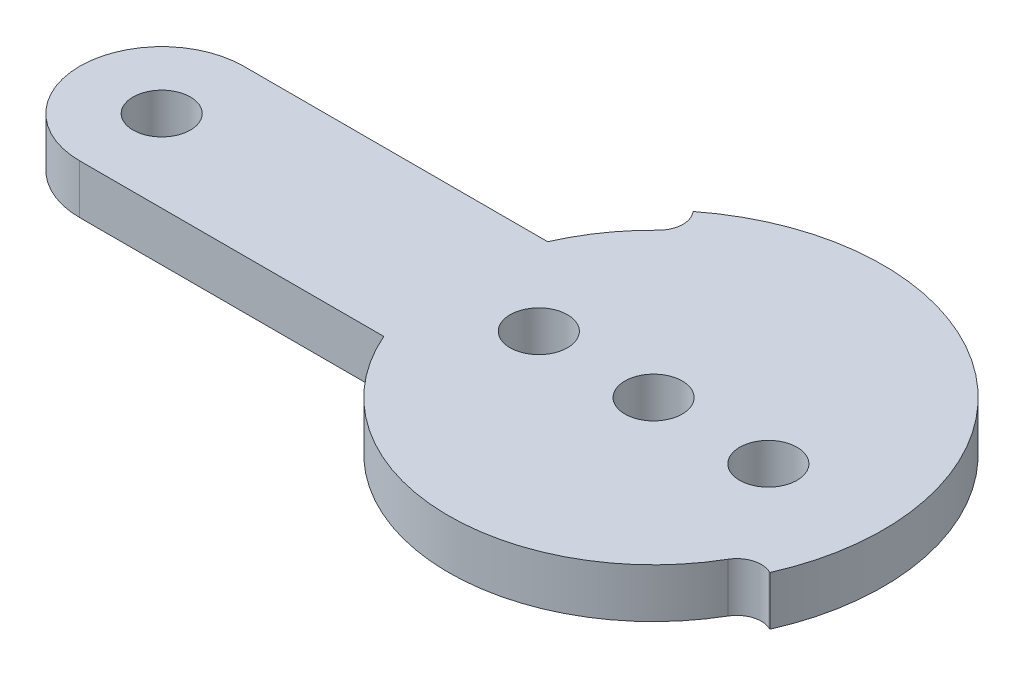
ISO-10303-21;
HEADER;
FILE_DESCRIPTION(('STEP AP214'),'2;1');
FILE_NAME('part.step','',(''),(''),'','','');
FILE_SCHEMA(('AUTOMOTIVE_DESIGN { 1 0 10303 214 1 1 1 1 }'));
ENDSEC;
DATA;
#1=APPLICATION_CONTEXT('core data for automotive mechanical design processes');
#2=APPLICATION_PROTOCOL_DEFINITION('international standard','automotive_design',2000,#1);
#3=PRODUCT_CONTEXT('',#1,'mechanical');
#4=PRODUCT('Part','Part','',(#3));
#5=PRODUCT_RELATED_PRODUCT_CATEGORY('part','',(#4));
#6=PRODUCT_DEFINITION_FORMATION('','',#4);
#7=PRODUCT_DEFINITION_CONTEXT('part definition',#1,'design');
#8=PRODUCT_DEFINITION('design','',#6,#7);
#9=PRODUCT_DEFINITION_SHAPE('','',#8);
#10=(LENGTH_UNIT() NAMED_UNIT(*) SI_UNIT(.MILLI.,.METRE.));
#11=(NAMED_UNIT(*) PLANE_ANGLE_UNIT() SI_UNIT($,.RADIAN.));
#12=(NAMED_UNIT(*) SI_UNIT($,.STERADIAN.) SOLID_ANGLE_UNIT());
#13=UNCERTAINTY_MEASURE_WITH_UNIT(LENGTH_MEASURE(1.E-05),#10,'distance_accuracy_value','');
#14=(GEOMETRIC_REPRESENTATION_CONTEXT(3) GLOBAL_UNCERTAINTY_ASSIGNED_CONTEXT((#13)) GLOBAL_UNIT_ASSIGNED_CONTEXT((#10,
#11,#12)) REPRESENTATION_CONTEXT('',''));
#15=CARTESIAN_POINT('',(0.,0.,0.));
#16=DIRECTION('',(0.,0.,1.));
#17=DIRECTION('',(1.,0.,0.));
#18=AXIS2_PLACEMENT_3D('',#15,#16,#17);
#19=CARTESIAN_POINT('',(0.,-3.,0.));
#20=DIRECTION('',(0.,1.,0.));
#21=DIRECTION('',(0.,0.,1.));
#22=AXIS2_PLACEMENT_3D('',#19,#20,#21);
#23=CYLINDRICAL_SURFACE('',#22,6.);
#24=CARTESIAN_POINT('',(0.,0.,0.));
#25=DIRECTION('',(0.,-1.,0.));
#26=DIRECTION('',(0.,0.,-1.));
#27=AXIS2_PLACEMENT_3D('',#24,#25,#26);
#28=CIRCLE('',#27,6.);
#29=CARTESIAN_POINT('',(-5.85267857142857,0.,-1.32142103038389));
#30=VERTEX_POINT('',#29);
#31=CARTESIAN_POINT('',(5.85267857142857,0.,-1.32142103038389));
#32=VERTEX_POINT('',#31);
#33=EDGE_CURVE('E170',#30,#32,#28,.T.);
#34=ORIENTED_EDGE('',*,*,#33,.T.);
#35=DIRECTION('',(0.,-1.,0.));
#36=VECTOR('',#35,1.);
#37=CARTESIAN_POINT('',(5.85267857142857,0.,-1.32142103038389));
#38=LINE('',#37,#36);
#39=CARTESIAN_POINT('',(5.85267857142857,-3.,-1.32142103038389));
#40=VERTEX_POINT('',#39);
#41=EDGE_CURVE('E168',#32,#40,#38,.T.);
#42=ORIENTED_EDGE('',*,*,#41,.T.);
#43=CARTESIAN_POINT('',(0.,-3.,0.));
#44=DIRECTION('',(0.,-1.,0.));
#45=DIRECTION('',(0.,0.,-1.));
#46=AXIS2_PLACEMENT_3D('',#43,#44,#45);
#47=CIRCLE('',#46,6.);
#48=CARTESIAN_POINT('',(-5.85267857142857,-3.,-1.32142103038389));
#49=VERTEX_POINT('',#48);
#50=EDGE_CURVE('E160',#49,#40,#47,.T.);
#51=ORIENTED_EDGE('',*,*,#50,.F.);
#52=DIRECTION('',(0.,-1.,0.));
#53=VECTOR('',#52,1.);
#54=CARTESIAN_POINT('',(-5.85267857142857,0.,-1.32142103038389));
#55=LINE('',#54,#53);
#56=EDGE_CURVE('E51',#49,#30,#55,.F.);
#57=ORIENTED_EDGE('',*,*,#56,.T.);
#58=EDGE_LOOP('',(#34,#42,#51,#57));
#59=FACE_BOUND('',#58,.T.);
#60=ADVANCED_FACE('F36',(#59),#23,.T.);
#61=CARTESIAN_POINT('',(12.1059096426056,3.,7.0318526524003));
#62=DIRECTION('',(0.,-1.,0.));
#63=DIRECTION('',(0.,0.,-1.));
#64=AXIS2_PLACEMENT_3D('',#61,#62,#63);
#65=PLANE('',#64);
#66=CARTESIAN_POINT('',(7.,3.,0.));
#67=DIRECTION('',(0.,-1.,0.));
#68=DIRECTION('',(0.,0.,-1.));
#69=AXIS2_PLACEMENT_3D('',#66,#67,#68);
#70=CIRCLE('',#69,1.75);
#71=CARTESIAN_POINT('',(7.,3.,-1.75));
#72=VERTEX_POINT('',#71);
#73=EDGE_CURVE('E145',#72,#72,#70,.T.);
#74=ORIENTED_EDGE('',*,*,#73,.T.);
#75=EDGE_LOOP('',(#74));
#76=FACE_BOUND('',#75,.T.);
#77=CARTESIAN_POINT('',(-7.,3.,0.));
#78=DIRECTION('',(0.,-1.,0.));
#79=DIRECTION('',(0.,0.,-1.));
#80=AXIS2_PLACEMENT_3D('',#77,#78,#79);
#81=CIRCLE('',#80,1.75);
#82=CARTESIAN_POINT('',(-7.,3.,-1.75));
#83=VERTEX_POINT('',#82);
#84=EDGE_CURVE('E144',#83,#83,#81,.T.);
#85=ORIENTED_EDGE('',*,*,#84,.T.);
#86=EDGE_LOOP('',(#85));
#87=FACE_BOUND('',#86,.T.);
#88=CARTESIAN_POINT('',(0.,3.,0.));
#89=DIRECTION('',(0.,-1.,0.));
#90=DIRECTION('',(0.,0.,-1.));
#91=AXIS2_PLACEMENT_3D('',#88,#89,#90);
#92=CIRCLE('',#91,1.75);
#93=CARTESIAN_POINT('',(0.,3.,-1.75));
#94=VERTEX_POINT('',#93);
#95=EDGE_CURVE('E422',#94,#94,#92,.T.);
#96=ORIENTED_EDGE('',*,*,#95,.T.);
#97=EDGE_LOOP('',(#96));
#98=FACE_BOUND('',#97,.T.);
#99=CARTESIAN_POINT('',(12.1059096426056,3.,7.0318526524003));
#100=DIRECTION('',(0.,-1.,0.));
#101=DIRECTION('',(0.,0.,-1.));
#102=AXIS2_PLACEMENT_3D('',#99,#100,#101);
#103=CIRCLE('',#102,1.5);
#104=CARTESIAN_POINT('',(10.8088478951836,3.,6.27843986821455));
#105=VERTEX_POINT('',#104);
#106=CARTESIAN_POINT('',(12.7160146072193,3.,5.6615344659364));
#107=VERTEX_POINT('',#106);
#108=EDGE_CURVE('E177',#105,#107,#103,.T.);
#109=ORIENTED_EDGE('',*,*,#108,.T.);
#110=DIRECTION('',(0.913545457642601,0.,0.4067366430758));
#111=VECTOR('',#110,1.);
#112=CARTESIAN_POINT('',(12.7160146072193,3.,5.6615344659364));
#113=LINE('',#112,#111);
#114=CARTESIAN_POINT('',(12.7896364069964,3.,5.69431300306121));
#115=VERTEX_POINT('',#114);
#116=EDGE_CURVE('E180',#107,#115,#113,.T.);
#117=ORIENTED_EDGE('',*,*,#116,.T.);
#118=CARTESIAN_POINT('',(0.,3.,0.));
#119=DIRECTION('',(0.,1.,0.));
#120=DIRECTION('',(0.,0.,1.));
#121=AXIS2_PLACEMENT_3D('',#118,#119,#120);
#122=CIRCLE('',#121,14.);
#123=CARTESIAN_POINT('',(-8.61926065455927,3.,-11.0321505504941));
#124=VERTEX_POINT('',#123);
#125=EDGE_CURVE('E183',#115,#124,#122,.T.);
#126=ORIENTED_EDGE('',*,*,#125,.T.);
#127=DIRECTION('',(0.61566147532566,0.,0.788010753606721));
#128=VECTOR('',#127,1.);
#129=CARTESIAN_POINT('',(-8.56964505471394,3.,-10.9686454786458));
#130=LINE('',#129,#128);
#131=CARTESIAN_POINT('',(-8.56964505471394,3.,-10.9686454786458));
#132=VERTEX_POINT('',#131);
#133=EDGE_CURVE('E185',#124,#132,#130,.T.);
#134=ORIENTED_EDGE('',*,*,#133,.T.);
#135=CARTESIAN_POINT('',(-9.75166118512402,3.,-10.0451532656573));
#136=DIRECTION('',(0.,-1.,0.));
#137=DIRECTION('',(0.,0.,-1.));
#138=AXIS2_PLACEMENT_3D('',#135,#136,#137);
#139=CIRCLE('',#138,1.5);
#140=CARTESIAN_POINT('',(-8.70684034386073,3.,-8.96888684433688));
#141=VERTEX_POINT('',#140);
#142=EDGE_CURVE('E187',#132,#141,#139,.T.);
#143=ORIENTED_EDGE('',*,*,#142,.T.);
#144=CARTESIAN_POINT('',(0.,3.,0.));
#145=DIRECTION('',(0.,1.,0.));
#146=DIRECTION('',(0.,0.,1.));
#147=AXIS2_PLACEMENT_3D('',#144,#145,#146);
#148=CIRCLE('',#147,12.5);
#149=CARTESIAN_POINT('',(-11.4564392373896,3.,-5.));
#150=VERTEX_POINT('',#149);
#151=EDGE_CURVE('E189',#141,#150,#148,.T.);
#152=ORIENTED_EDGE('',*,*,#151,.T.);
#153=DIRECTION('',(-1.,0.,0.));
#154=VECTOR('',#153,1.);
#155=CARTESIAN_POINT('',(-30.,3.,-5.));
#156=LINE('',#155,#154);
#157=CARTESIAN_POINT('',(-30.,3.,-5.));
#158=VERTEX_POINT('',#157);
#159=EDGE_CURVE('E191',#150,#158,#156,.T.);
#160=ORIENTED_EDGE('',*,*,#159,.T.);
#161=CARTESIAN_POINT('',(-30.,3.,0.));
#162=DIRECTION('',(0.,1.,0.));
#163=DIRECTION('',(0.,0.,1.));
#164=AXIS2_PLACEMENT_3D('',#161,#162,#163);
#165=CIRCLE('',#164,5.);
#166=CARTESIAN_POINT('',(-30.,3.,5.));
#167=VERTEX_POINT('',#166);
#168=EDGE_CURVE('E193',#158,#167,#165,.T.);
#169=ORIENTED_EDGE('',*,*,#168,.T.);
#170=DIRECTION('',(1.,0.,0.));
#171=VECTOR('',#170,1.);
#172=CARTESIAN_POINT('',(-30.,3.,5.));
#173=LINE('',#172,#171);
#174=CARTESIAN_POINT('',(-11.4564392373896,3.,5.00000000000001));
#175=VERTEX_POINT('',#174);
#176=EDGE_CURVE('E196',#167,#175,#173,.T.);
#177=ORIENTED_EDGE('',*,*,#176,.T.);
#178=CARTESIAN_POINT('',(0.,3.,0.));
#179=DIRECTION('',(0.,1.,0.));
#180=DIRECTION('',(0.,0.,1.));
#181=AXIS2_PLACEMENT_3D('',#178,#179,#180);
#182=CIRCLE('',#181,12.5);
#183=EDGE_CURVE('E199',#175,#105,#182,.T.);
#184=ORIENTED_EDGE('',*,*,#183,.T.);
#185=EDGE_LOOP('',(#109,#117,#126,#134,#143,#152,#160,#169,#177,#184));
#186=FACE_BOUND('',#185,.T.);
#187=CARTESIAN_POINT('',(-30.,3.,0.));
#188=DIRECTION('',(0.,1.,0.));
#189=DIRECTION('',(0.,0.,1.));
#190=AXIS2_PLACEMENT_3D('',#187,#188,#189);
#191=CIRCLE('',#190,1.75);
#192=CARTESIAN_POINT('',(-30.,3.,1.75));
#193=VERTEX_POINT('',#192);
#194=EDGE_CURVE('E163',#193,#193,#191,.T.);
#195=ORIENTED_EDGE('',*,*,#194,.F.);
#196=EDGE_LOOP('',(#195));
#197=FACE_BOUND('',#196,.T.);
#198=ADVANCED_FACE('F268',(#76,#87,#98,#186,#197),#65,.F.);
#199=CARTESIAN_POINT('',(12.1059096426056,0.,7.0318526524003));
#200=DIRECTION('',(0.,-1.,0.));
#201=DIRECTION('',(0.,0.,-1.));
#202=AXIS2_PLACEMENT_3D('',#199,#200,#201);
#203=PLANE('',#202);
#204=CARTESIAN_POINT('',(7.,0.,0.));
#205=DIRECTION('',(0.,-1.,0.));
#206=DIRECTION('',(0.,0.,-1.));
#207=AXIS2_PLACEMENT_3D('',#204,#205,#206);
#208=CIRCLE('',#207,1.75);
#209=CARTESIAN_POINT('',(5.85267857142857,0.,1.32142103038389));
#210=VERTEX_POINT('',#209);
#211=EDGE_CURVE('E416',#32,#210,#208,.T.);
#212=ORIENTED_EDGE('',*,*,#211,.F.);
#213=ORIENTED_EDGE('',*,*,#33,.F.);
#214=CARTESIAN_POINT('',(-7.,0.,0.));
#215=DIRECTION('',(0.,-1.,0.));
#216=DIRECTION('',(0.,0.,-1.));
#217=AXIS2_PLACEMENT_3D('',#214,#215,#216);
#218=CIRCLE('',#217,1.75);
#219=CARTESIAN_POINT('',(-5.85267857142857,0.,1.32142103038389));
#220=VERTEX_POINT('',#219);
#221=EDGE_CURVE('E154',#220,#30,#218,.T.);
#222=ORIENTED_EDGE('',*,*,#221,.F.);
#223=EDGE_CURVE('E153',#210,#220,#28,.T.);
#224=ORIENTED_EDGE('',*,*,#223,.F.);
#225=EDGE_LOOP('',(#212,#213,#222,#224));
#226=FACE_BOUND('',#225,.T.);
#227=CARTESIAN_POINT('',(12.1059096426056,0.,7.0318526524003));
#228=DIRECTION('',(0.,-1.,0.));
#229=DIRECTION('',(0.,0.,-1.));
#230=AXIS2_PLACEMENT_3D('',#227,#228,#229);
#231=CIRCLE('',#230,1.5);
#232=CARTESIAN_POINT('',(10.8088478951836,0.,6.27843986821455));
#233=VERTEX_POINT('',#232);
#234=CARTESIAN_POINT('',(12.7160146072193,0.,5.6615344659364));
#235=VERTEX_POINT('',#234);
#236=EDGE_CURVE('E175',#233,#235,#231,.T.);
#237=ORIENTED_EDGE('',*,*,#236,.F.);
#238=CARTESIAN_POINT('',(0.,0.,0.));
#239=DIRECTION('',(0.,1.,0.));
#240=DIRECTION('',(0.,0.,1.));
#241=AXIS2_PLACEMENT_3D('',#238,#239,#240);
#242=CIRCLE('',#241,12.5);
#243=CARTESIAN_POINT('',(-11.4564392373896,0.,5.00000000000001));
#244=VERTEX_POINT('',#243);
#245=EDGE_CURVE('E181',#244,#233,#242,.T.);
#246=ORIENTED_EDGE('',*,*,#245,.F.);
#247=DIRECTION('',(1.,0.,0.));
#248=VECTOR('',#247,1.);
#249=CARTESIAN_POINT('',(-30.,0.,5.));
#250=LINE('',#249,#248);
#251=CARTESIAN_POINT('',(-30.,0.,5.));
#252=VERTEX_POINT('',#251);
#253=EDGE_CURVE('E218',#252,#244,#250,.T.);
#254=ORIENTED_EDGE('',*,*,#253,.F.);
#255=CARTESIAN_POINT('',(-30.,0.,0.));
#256=DIRECTION('',(0.,1.,0.));
#257=DIRECTION('',(0.,0.,1.));
#258=AXIS2_PLACEMENT_3D('',#255,#256,#257);
#259=CIRCLE('',#258,5.);
#260=CARTESIAN_POINT('',(-30.,0.,-5.));
#261=VERTEX_POINT('',#260);
#262=EDGE_CURVE('E216',#261,#252,#259,.T.);
#263=ORIENTED_EDGE('',*,*,#262,.F.);
#264=DIRECTION('',(-1.,0.,0.));
#265=VECTOR('',#264,1.);
#266=CARTESIAN_POINT('',(-30.,0.,-5.));
#267=LINE('',#266,#265);
#268=CARTESIAN_POINT('',(-11.4564392373896,0.,-5.));
#269=VERTEX_POINT('',#268);
#270=EDGE_CURVE('E214',#269,#261,#267,.T.);
#271=ORIENTED_EDGE('',*,*,#270,.F.);
#272=CARTESIAN_POINT('',(0.,0.,0.));
#273=DIRECTION('',(0.,1.,0.));
#274=DIRECTION('',(0.,0.,1.));
#275=AXIS2_PLACEMENT_3D('',#272,#273,#274);
#276=CIRCLE('',#275,12.5);
#277=CARTESIAN_POINT('',(-8.70684034386073,0.,-8.96888684433688));
#278=VERTEX_POINT('',#277);
#279=EDGE_CURVE('E212',#278,#269,#276,.T.);
#280=ORIENTED_EDGE('',*,*,#279,.F.);
#281=CARTESIAN_POINT('',(-9.75166118512402,0.,-10.0451532656573));
#282=DIRECTION('',(0.,-1.,0.));
#283=DIRECTION('',(0.,0.,-1.));
#284=AXIS2_PLACEMENT_3D('',#281,#282,#283);
#285=CIRCLE('',#284,1.5);
#286=CARTESIAN_POINT('',(-8.56964505471394,0.,-10.9686454786458));
#287=VERTEX_POINT('',#286);
#288=EDGE_CURVE('E210',#287,#278,#285,.T.);
#289=ORIENTED_EDGE('',*,*,#288,.F.);
#290=DIRECTION('',(0.61566147532566,0.,0.788010753606721));
#291=VECTOR('',#290,1.);
#292=CARTESIAN_POINT('',(-8.56964505471394,0.,-10.9686454786458));
#293=LINE('',#292,#291);
#294=CARTESIAN_POINT('',(-8.61926065455927,0.,-11.0321505504941));
#295=VERTEX_POINT('',#294);
#296=EDGE_CURVE('E208',#295,#287,#293,.T.);
#297=ORIENTED_EDGE('',*,*,#296,.F.);
#298=CARTESIAN_POINT('',(0.,0.,0.));
#299=DIRECTION('',(0.,1.,0.));
#300=DIRECTION('',(0.,0.,1.));
#301=AXIS2_PLACEMENT_3D('',#298,#299,#300);
#302=CIRCLE('',#301,14.);
#303=CARTESIAN_POINT('',(12.7896364069964,0.,5.69431300306121));
#304=VERTEX_POINT('',#303);
#305=EDGE_CURVE('E206',#304,#295,#302,.T.);
#306=ORIENTED_EDGE('',*,*,#305,.F.);
#307=DIRECTION('',(0.913545457642601,0.,0.4067366430758));
#308=VECTOR('',#307,1.);
#309=CARTESIAN_POINT('',(12.7160146072193,0.,5.6615344659364));
#310=LINE('',#309,#308);
#311=EDGE_CURVE('E204',#235,#304,#310,.T.);
#312=ORIENTED_EDGE('',*,*,#311,.F.);
#313=EDGE_LOOP('',(#237,#246,#254,#263,#271,#280,#289,#297,#306,#312));
#314=FACE_BOUND('',#313,.T.);
#315=CARTESIAN_POINT('',(-30.,0.,0.));
#316=DIRECTION('',(0.,1.,0.));
#317=DIRECTION('',(0.,0.,1.));
#318=AXIS2_PLACEMENT_3D('',#315,#316,#317);
#319=CIRCLE('',#318,1.75);
#320=CARTESIAN_POINT('',(-30.,0.,1.75));
#321=VERTEX_POINT('',#320);
#322=EDGE_CURVE('E159',#321,#321,#319,.T.);
#323=ORIENTED_EDGE('',*,*,#322,.T.);
#324=EDGE_LOOP('',(#323));
#325=FACE_BOUND('',#324,.T.);
#326=ADVANCED_FACE('F254',(#226,#314,#325),#203,.T.);
#327=CARTESIAN_POINT('',(12.1059096426056,3.,7.0318526524003));
#328=DIRECTION('',(0.,-1.,0.));
#329=DIRECTION('',(0.,0.,-1.));
#330=AXIS2_PLACEMENT_3D('',#327,#328,#329);
#331=CYLINDRICAL_SURFACE('',#330,1.5);
#332=ORIENTED_EDGE('',*,*,#236,.T.);
#333=DIRECTION('',(0.,-1.,0.));
#334=VECTOR('',#333,1.);
#335=CARTESIAN_POINT('',(12.7160146072193,3.,5.6615344659364));
#336=LINE('',#335,#334);
#337=EDGE_CURVE('E11',#107,#235,#336,.T.);
#338=ORIENTED_EDGE('',*,*,#337,.F.);
#339=ORIENTED_EDGE('',*,*,#108,.F.);
#340=DIRECTION('',(0.,-1.,0.));
#341=VECTOR('',#340,1.);
#342=CARTESIAN_POINT('',(10.8088478951836,3.,6.27843986821455));
#343=LINE('',#342,#341);
#344=EDGE_CURVE('E201',#105,#233,#343,.T.);
#345=ORIENTED_EDGE('',*,*,#344,.T.);
#346=EDGE_LOOP('',(#332,#338,#339,#345));
#347=FACE_BOUND('',#346,.T.);
#348=ADVANCED_FACE('F38',(#347),#331,.F.);
#349=CARTESIAN_POINT('',(12.7160146072193,3.,5.6615344659364));
#350=DIRECTION('',(0.4067366430758,0.,-0.913545457642601));
#351=DIRECTION('',(-0.913545457642601,0.,-0.4067366430758));
#352=AXIS2_PLACEMENT_3D('',#349,#350,#351);
#353=PLANE('',#352);
#354=ORIENTED_EDGE('',*,*,#311,.T.);
#355=DIRECTION('',(0.,-1.,0.));
#356=VECTOR('',#355,1.);
#357=CARTESIAN_POINT('',(12.7896364069964,3.,5.69431300306121));
#358=LINE('',#357,#356);
#359=EDGE_CURVE('E44',#115,#304,#358,.T.);
#360=ORIENTED_EDGE('',*,*,#359,.F.);
#361=ORIENTED_EDGE('',*,*,#116,.F.);
#362=ORIENTED_EDGE('',*,*,#337,.T.);
#363=EDGE_LOOP('',(#354,#360,#361,#362));
#364=FACE_BOUND('',#363,.T.);
#365=ADVANCED_FACE('F273',(#364),#353,.F.);
#366=CARTESIAN_POINT('',(0.,3.,0.));
#367=DIRECTION('',(0.,-1.,0.));
#368=DIRECTION('',(0.,0.,-1.));
#369=AXIS2_PLACEMENT_3D('',#366,#367,#368);
#370=CYLINDRICAL_SURFACE('',#369,14.);
#371=ORIENTED_EDGE('',*,*,#305,.T.);
#372=DIRECTION('',(0.,-1.,0.));
#373=VECTOR('',#372,1.);
#374=CARTESIAN_POINT('',(-8.61926065455927,3.,-11.0321505504941));
#375=LINE('',#374,#373);
#376=EDGE_CURVE('E241',#124,#295,#375,.T.);
#377=ORIENTED_EDGE('',*,*,#376,.F.);
#378=ORIENTED_EDGE('',*,*,#125,.F.);
#379=ORIENTED_EDGE('',*,*,#359,.T.);
#380=EDGE_LOOP('',(#371,#377,#378,#379));
#381=FACE_BOUND('',#380,.T.);
#382=ADVANCED_FACE('F248',(#381),#370,.T.);
#383=CARTESIAN_POINT('',(-8.56964505471394,3.,-10.9686454786458));
#384=DIRECTION('',(0.788010753606721,0.,-0.61566147532566));
#385=DIRECTION('',(-0.61566147532566,0.,-0.788010753606721));
#386=AXIS2_PLACEMENT_3D('',#383,#384,#385);
#387=PLANE('',#386);
#388=ORIENTED_EDGE('',*,*,#296,.T.);
#389=DIRECTION('',(0.,-1.,0.));
#390=VECTOR('',#389,1.);
#391=CARTESIAN_POINT('',(-8.56964505471394,3.,-10.9686454786458));
#392=LINE('',#391,#390);
#393=EDGE_CURVE('E238',#132,#287,#392,.T.);
#394=ORIENTED_EDGE('',*,*,#393,.F.);
#395=ORIENTED_EDGE('',*,*,#133,.F.);
#396=ORIENTED_EDGE('',*,*,#376,.T.);
#397=EDGE_LOOP('',(#388,#394,#395,#396));
#398=FACE_BOUND('',#397,.T.);
#399=ADVANCED_FACE('F260',(#398),#387,.F.);
#400=CARTESIAN_POINT('',(-9.75166118512402,3.,-10.0451532656573));
#401=DIRECTION('',(0.,-1.,0.));
#402=DIRECTION('',(0.,0.,-1.));
#403=AXIS2_PLACEMENT_3D('',#400,#401,#402);
#404=CYLINDRICAL_SURFACE('',#403,1.5);
#405=ORIENTED_EDGE('',*,*,#288,.T.);
#406=DIRECTION('',(0.,-1.,0.));
#407=VECTOR('',#406,1.);
#408=CARTESIAN_POINT('',(-8.70684034386073,3.,-8.96888684433688));
#409=LINE('',#408,#407);
#410=EDGE_CURVE('E235',#141,#278,#409,.T.);
#411=ORIENTED_EDGE('',*,*,#410,.F.);
#412=ORIENTED_EDGE('',*,*,#142,.F.);
#413=ORIENTED_EDGE('',*,*,#393,.T.);
#414=EDGE_LOOP('',(#405,#411,#412,#413));
#415=FACE_BOUND('',#414,.T.);
#416=ADVANCED_FACE('F264',(#415),#404,.F.);
#417=CARTESIAN_POINT('',(0.,3.,0.));
#418=DIRECTION('',(0.,-1.,0.));
#419=DIRECTION('',(0.,0.,-1.));
#420=AXIS2_PLACEMENT_3D('',#417,#418,#419);
#421=CYLINDRICAL_SURFACE('',#420,12.5);
#422=ORIENTED_EDGE('',*,*,#279,.T.);
#423=DIRECTION('',(0.,-1.,0.));
#424=VECTOR('',#423,1.);
#425=CARTESIAN_POINT('',(-11.4564392373896,3.,-5.));
#426=LINE('',#425,#424);
#427=EDGE_CURVE('E232',#150,#269,#426,.T.);
#428=ORIENTED_EDGE('',*,*,#427,.F.);
#429=ORIENTED_EDGE('',*,*,#151,.F.);
#430=ORIENTED_EDGE('',*,*,#410,.T.);
#431=EDGE_LOOP('',(#422,#428,#429,#430));
#432=FACE_BOUND('',#431,.T.);
#433=ADVANCED_FACE('F296',(#432),#421,.T.);
#434=CARTESIAN_POINT('',(-30.,3.,-5.));
#435=DIRECTION('',(0.,0.,1.));
#436=DIRECTION('',(1.,0.,0.));
#437=AXIS2_PLACEMENT_3D('',#434,#435,#436);
#438=PLANE('',#437);
#439=ORIENTED_EDGE('',*,*,#270,.T.);
#440=DIRECTION('',(0.,-1.,0.));
#441=VECTOR('',#440,1.);
#442=CARTESIAN_POINT('',(-30.,3.,-5.));
#443=LINE('',#442,#441);
#444=EDGE_CURVE('E229',#158,#261,#443,.T.);
#445=ORIENTED_EDGE('',*,*,#444,.F.);
#446=ORIENTED_EDGE('',*,*,#159,.F.);
#447=ORIENTED_EDGE('',*,*,#427,.T.);
#448=EDGE_LOOP('',(#439,#445,#446,#447));
#449=FACE_BOUND('',#448,.T.);
#450=ADVANCED_FACE('F293',(#449),#438,.F.);
#451=CARTESIAN_POINT('',(-30.,3.,0.));
#452=DIRECTION('',(0.,-1.,0.));
#453=DIRECTION('',(0.,0.,-1.));
#454=AXIS2_PLACEMENT_3D('',#451,#452,#453);
#455=CYLINDRICAL_SURFACE('',#454,5.);
#456=ORIENTED_EDGE('',*,*,#262,.T.);
#457=DIRECTION('',(0.,-1.,0.));
#458=VECTOR('',#457,1.);
#459=CARTESIAN_POINT('',(-30.,3.,5.));
#460=LINE('',#459,#458);
#461=EDGE_CURVE('E226',#167,#252,#460,.T.);
#462=ORIENTED_EDGE('',*,*,#461,.F.);
#463=ORIENTED_EDGE('',*,*,#168,.F.);
#464=ORIENTED_EDGE('',*,*,#444,.T.);
#465=EDGE_LOOP('',(#456,#462,#463,#464));
#466=FACE_BOUND('',#465,.T.);
#467=ADVANCED_FACE('F289',(#466),#455,.T.);
#468=CARTESIAN_POINT('',(-30.,3.,5.));
#469=DIRECTION('',(0.,0.,-1.));
#470=DIRECTION('',(-1.,0.,0.));
#471=AXIS2_PLACEMENT_3D('',#468,#469,#470);
#472=PLANE('',#471);
#473=ORIENTED_EDGE('',*,*,#253,.T.);
#474=DIRECTION('',(0.,-1.,0.));
#475=VECTOR('',#474,1.);
#476=CARTESIAN_POINT('',(-11.4564392373896,3.,5.00000000000001));
#477=LINE('',#476,#475);
#478=EDGE_CURVE('E223',#175,#244,#477,.T.);
#479=ORIENTED_EDGE('',*,*,#478,.F.);
#480=ORIENTED_EDGE('',*,*,#176,.F.);
#481=ORIENTED_EDGE('',*,*,#461,.T.);
#482=EDGE_LOOP('',(#473,#479,#480,#481));
#483=FACE_BOUND('',#482,.T.);
#484=ADVANCED_FACE('F285',(#483),#472,.F.);
#485=CARTESIAN_POINT('',(0.,3.,0.));
#486=DIRECTION('',(0.,-1.,0.));
#487=DIRECTION('',(0.,0.,-1.));
#488=AXIS2_PLACEMENT_3D('',#485,#486,#487);
#489=CYLINDRICAL_SURFACE('',#488,12.5);
#490=ORIENTED_EDGE('',*,*,#245,.T.);
#491=ORIENTED_EDGE('',*,*,#344,.F.);
#492=ORIENTED_EDGE('',*,*,#183,.F.);
#493=ORIENTED_EDGE('',*,*,#478,.T.);
#494=EDGE_LOOP('',(#490,#491,#492,#493));
#495=FACE_BOUND('',#494,.T.);
#496=ADVANCED_FACE('F280',(#495),#489,.T.);
#497=CARTESIAN_POINT('',(-30.,3.,0.));
#498=DIRECTION('',(0.,-1.,0.));
#499=DIRECTION('',(0.,0.,-1.));
#500=AXIS2_PLACEMENT_3D('',#497,#498,#499);
#501=CYLINDRICAL_SURFACE('',#500,1.75);
#502=ORIENTED_EDGE('',*,*,#194,.T.);
#503=EDGE_LOOP('',(#502));
#504=FACE_BOUND('',#503,.T.);
#505=ORIENTED_EDGE('',*,*,#322,.F.);
#506=EDGE_LOOP('',(#505));
#507=FACE_BOUND('',#506,.T.);
#508=ADVANCED_FACE('F316',(#504,#507),#501,.F.);
#509=CARTESIAN_POINT('',(5.85267857142857,-3.,1.32142103038389));
#510=VERTEX_POINT('',#509);
#511=CARTESIAN_POINT('',(-5.85267857142857,-3.,1.32142103038389));
#512=VERTEX_POINT('',#511);
#513=EDGE_CURVE('E151',#510,#512,#47,.T.);
#514=ORIENTED_EDGE('',*,*,#513,.F.);
#515=DIRECTION('',(0.,-1.,0.));
#516=VECTOR('',#515,1.);
#517=CARTESIAN_POINT('',(5.85267857142857,0.,1.32142103038389));
#518=LINE('',#517,#516);
#519=EDGE_CURVE('E59',#510,#210,#518,.F.);
#520=ORIENTED_EDGE('',*,*,#519,.T.);
#521=ORIENTED_EDGE('',*,*,#223,.T.);
#522=DIRECTION('',(0.,-1.,0.));
#523=VECTOR('',#522,1.);
#524=CARTESIAN_POINT('',(-5.85267857142857,0.,1.32142103038389));
#525=LINE('',#524,#523);
#526=EDGE_CURVE('E137',#220,#512,#525,.T.);
#527=ORIENTED_EDGE('',*,*,#526,.T.);
#528=EDGE_LOOP('',(#514,#520,#521,#527));
#529=FACE_BOUND('',#528,.T.);
#530=ADVANCED_FACE('F150',(#529),#23,.T.);
#531=CARTESIAN_POINT('',(0.,-3.,0.));
#532=DIRECTION('',(0.,-1.,0.));
#533=DIRECTION('',(0.,0.,-1.));
#534=AXIS2_PLACEMENT_3D('',#531,#532,#533);
#535=PLANE('',#534);
#536=CARTESIAN_POINT('',(7.,-3.,0.));
#537=DIRECTION('',(0.,-1.,0.));
#538=DIRECTION('',(0.,0.,-1.));
#539=AXIS2_PLACEMENT_3D('',#536,#537,#538);
#540=CIRCLE('',#539,1.75);
#541=EDGE_CURVE('E158',#510,#40,#540,.T.);
#542=ORIENTED_EDGE('',*,*,#541,.F.);
#543=ORIENTED_EDGE('',*,*,#513,.T.);
#544=CARTESIAN_POINT('',(-7.,-3.,0.));
#545=DIRECTION('',(0.,-1.,0.));
#546=DIRECTION('',(0.,0.,-1.));
#547=AXIS2_PLACEMENT_3D('',#544,#545,#546);
#548=CIRCLE('',#547,1.75);
#549=EDGE_CURVE('E134',#49,#512,#548,.T.);
#550=ORIENTED_EDGE('',*,*,#549,.F.);
#551=ORIENTED_EDGE('',*,*,#50,.T.);
#552=EDGE_LOOP('',(#542,#543,#550,#551));
#553=FACE_BOUND('',#552,.T.);
#554=CARTESIAN_POINT('',(0.,-3.,0.));
#555=DIRECTION('',(0.,-1.,0.));
#556=DIRECTION('',(0.,0.,-1.));
#557=AXIS2_PLACEMENT_3D('',#554,#555,#556);
#558=CIRCLE('',#557,1.75);
#559=CARTESIAN_POINT('',(0.,-3.,-1.75));
#560=VERTEX_POINT('',#559);
#561=EDGE_CURVE('E425',#560,#560,#558,.T.);
#562=ORIENTED_EDGE('',*,*,#561,.F.);
#563=EDGE_LOOP('',(#562));
#564=FACE_BOUND('',#563,.T.);
#565=ADVANCED_FACE('F156',(#553,#564),#535,.T.);
#566=CARTESIAN_POINT('',(0.,3.,0.));
#567=DIRECTION('',(0.,-1.,0.));
#568=DIRECTION('',(0.,0.,-1.));
#569=AXIS2_PLACEMENT_3D('',#566,#567,#568);
#570=CYLINDRICAL_SURFACE('',#569,1.75);
#571=ORIENTED_EDGE('',*,*,#95,.F.);
#572=EDGE_LOOP('',(#571));
#573=FACE_BOUND('',#572,.T.);
#574=ORIENTED_EDGE('',*,*,#561,.T.);
#575=EDGE_LOOP('',(#574));
#576=FACE_BOUND('',#575,.T.);
#577=ADVANCED_FACE('F321',(#573,#576),#570,.F.);
#578=CARTESIAN_POINT('',(-7.,3.,0.));
#579=DIRECTION('',(0.,-1.,0.));
#580=DIRECTION('',(0.,0.,-1.));
#581=AXIS2_PLACEMENT_3D('',#578,#579,#580);
#582=CYLINDRICAL_SURFACE('',#581,1.75);
#583=ORIENTED_EDGE('',*,*,#84,.F.);
#584=EDGE_LOOP('',(#583));
#585=FACE_BOUND('',#584,.T.);
#586=ORIENTED_EDGE('',*,*,#221,.T.);
#587=ORIENTED_EDGE('',*,*,#56,.F.);
#588=ORIENTED_EDGE('',*,*,#549,.T.);
#589=ORIENTED_EDGE('',*,*,#526,.F.);
#590=EDGE_LOOP('',(#586,#587,#588,#589));
#591=FACE_BOUND('',#590,.T.);
#592=ADVANCED_FACE('F136',(#585,#591),#582,.F.);
#593=CARTESIAN_POINT('',(7.,3.,0.));
#594=DIRECTION('',(0.,-1.,0.));
#595=DIRECTION('',(0.,0.,-1.));
#596=AXIS2_PLACEMENT_3D('',#593,#594,#595);
#597=CYLINDRICAL_SURFACE('',#596,1.75);
#598=ORIENTED_EDGE('',*,*,#73,.F.);
#599=EDGE_LOOP('',(#598));
#600=FACE_BOUND('',#599,.T.);
#601=ORIENTED_EDGE('',*,*,#211,.T.);
#602=ORIENTED_EDGE('',*,*,#519,.F.);
#603=ORIENTED_EDGE('',*,*,#541,.T.);
#604=ORIENTED_EDGE('',*,*,#41,.F.);
#605=EDGE_LOOP('',(#601,#602,#603,#604));
#606=FACE_BOUND('',#605,.T.);
#607=ADVANCED_FACE('F399',(#600,#606),#597,.F.);
#608=CLOSED_SHELL('',(#60,#198,#326,#348,#365,#382,#399,#416,#433,#450,#467,#484,#496,#508,#530,
#565,#577,#592,#607));
#609=MANIFOLD_SOLID_BREP('B2',#608);
#610=ADVANCED_BREP_SHAPE_REPRESENTATION('',(#18,#609),#14);
#611=SHAPE_DEFINITION_REPRESENTATION(#9,#610);
ENDSEC;
END-ISO-10303-21;
